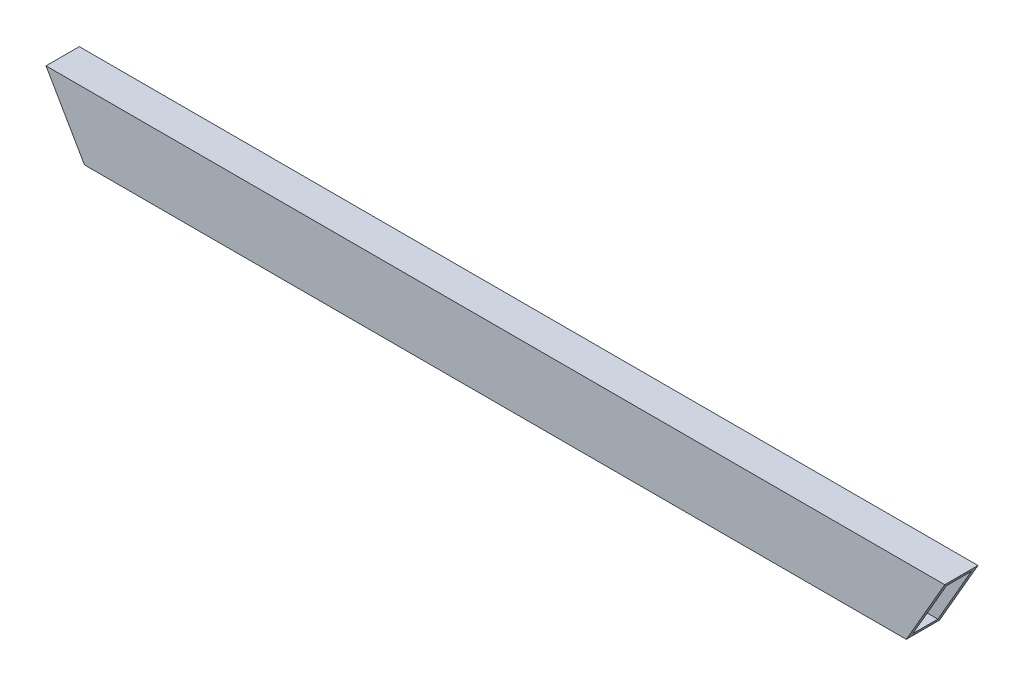
ISO-10303-21;
HEADER;
FILE_DESCRIPTION(('STEP AP214'),'2;1');
FILE_NAME('part.step','',(''),(''),'','','');
FILE_SCHEMA(('AUTOMOTIVE_DESIGN { 1 0 10303 214 1 1 1 1 }'));
ENDSEC;
DATA;
#1=APPLICATION_CONTEXT('core data for automotive mechanical design processes');
#2=APPLICATION_PROTOCOL_DEFINITION('international standard','automotive_design',2000,#1);
#3=PRODUCT_CONTEXT('',#1,'mechanical');
#4=PRODUCT('Part','Part','',(#3));
#5=PRODUCT_RELATED_PRODUCT_CATEGORY('part','',(#4));
#6=PRODUCT_DEFINITION_FORMATION('','',#4);
#7=PRODUCT_DEFINITION_CONTEXT('part definition',#1,'design');
#8=PRODUCT_DEFINITION('design','',#6,#7);
#9=PRODUCT_DEFINITION_SHAPE('','',#8);
#10=(LENGTH_UNIT() NAMED_UNIT(*) SI_UNIT(.MILLI.,.METRE.));
#11=(NAMED_UNIT(*) PLANE_ANGLE_UNIT() SI_UNIT($,.RADIAN.));
#12=(NAMED_UNIT(*) SI_UNIT($,.STERADIAN.) SOLID_ANGLE_UNIT());
#13=UNCERTAINTY_MEASURE_WITH_UNIT(LENGTH_MEASURE(1.E-05),#10,'distance_accuracy_value','');
#14=(GEOMETRIC_REPRESENTATION_CONTEXT(3) GLOBAL_UNCERTAINTY_ASSIGNED_CONTEXT((#13)) GLOBAL_UNIT_ASSIGNED_CONTEXT((#10,
#11,#12)) REPRESENTATION_CONTEXT('',''));
#15=CARTESIAN_POINT('',(0.,0.,0.));
#16=DIRECTION('',(0.,0.,1.));
#17=DIRECTION('',(1.,0.,0.));
#18=AXIS2_PLACEMENT_3D('',#15,#16,#17);
#19=CARTESIAN_POINT('',(342.9,-22.225,9.525));
#20=DIRECTION('',(0.,1.,0.));
#21=DIRECTION('',(0.,0.,1.));
#22=AXIS2_PLACEMENT_3D('',#19,#20,#21);
#23=PLANE('',#22);
#24=DIRECTION('',(0.,0.,-1.));
#25=VECTOR('',#24,1.);
#26=CARTESIAN_POINT('',(-315.403693429844,-22.225,9.525));
#27=LINE('',#26,#25);
#28=CARTESIAN_POINT('',(-315.403693429844,-22.225,9.525));
#29=VERTEX_POINT('',#28);
#30=CARTESIAN_POINT('',(-315.403693429844,-22.225,-9.525));
#31=VERTEX_POINT('',#30);
#32=EDGE_CURVE('E11',#29,#31,#27,.T.);
#33=ORIENTED_EDGE('',*,*,#32,.F.);
#34=DIRECTION('',(-1.,0.,0.));
#35=VECTOR('',#34,1.);
#36=CARTESIAN_POINT('',(342.9,-22.225,9.525));
#37=LINE('',#36,#35);
#38=CARTESIAN_POINT('',(315.403693429844,-22.225,9.525));
#39=VERTEX_POINT('',#38);
#40=EDGE_CURVE('E149',#39,#29,#37,.T.);
#41=ORIENTED_EDGE('',*,*,#40,.F.);
#42=DIRECTION('',(0.,0.,-1.));
#43=VECTOR('',#42,1.);
#44=CARTESIAN_POINT('',(315.403693429844,-22.225,9.525));
#45=LINE('',#44,#43);
#46=CARTESIAN_POINT('',(315.403693429844,-22.225,-9.525));
#47=VERTEX_POINT('',#46);
#48=EDGE_CURVE('E52',#39,#47,#45,.T.);
#49=ORIENTED_EDGE('',*,*,#48,.T.);
#50=DIRECTION('',(-1.,0.,0.));
#51=VECTOR('',#50,1.);
#52=CARTESIAN_POINT('',(342.9,-22.225,-9.525));
#53=LINE('',#52,#51);
#54=EDGE_CURVE('E147',#47,#31,#53,.T.);
#55=ORIENTED_EDGE('',*,*,#54,.T.);
#56=EDGE_LOOP('',(#33,#41,#49,#55));
#57=FACE_BOUND('',#56,.T.);
#58=ADVANCED_FACE('F43',(#57),#23,.T.);
#59=CARTESIAN_POINT('',(342.9,-22.225,9.525));
#60=DIRECTION('',(0.,0.,-1.));
#61=DIRECTION('',(-1.,0.,0.));
#62=AXIS2_PLACEMENT_3D('',#59,#60,#61);
#63=PLANE('',#62);
#64=DIRECTION('',(0.500000000000004,-0.866025403784436,0.));
#65=VECTOR('',#64,1.);
#66=CARTESIAN_POINT('',(-150.82777007238,-307.278860957686,9.525));
#67=LINE('',#66,#65);
#68=CARTESIAN_POINT('',(-341.066912895323,22.2250000000001,9.525));
#69=VERTEX_POINT('',#68);
#70=EDGE_CURVE('E201',#69,#29,#67,.T.);
#71=ORIENTED_EDGE('',*,*,#70,.F.);
#72=DIRECTION('',(-1.,0.,0.));
#73=VECTOR('',#72,1.);
#74=CARTESIAN_POINT('',(342.9,22.225,9.525));
#75=LINE('',#74,#73);
#76=CARTESIAN_POINT('',(341.066912895323,22.225,9.525));
#77=VERTEX_POINT('',#76);
#78=EDGE_CURVE('E164',#77,#69,#75,.T.);
#79=ORIENTED_EDGE('',*,*,#78,.F.);
#80=DIRECTION('',(-0.500000000000004,-0.866025403784436,0.));
#81=VECTOR('',#80,1.);
#82=CARTESIAN_POINT('',(322.277770072383,-10.3187499999998,9.525));
#83=LINE('',#82,#81);
#84=EDGE_CURVE('E184',#77,#39,#83,.T.);
#85=ORIENTED_EDGE('',*,*,#84,.T.);
#86=ORIENTED_EDGE('',*,*,#40,.T.);
#87=EDGE_LOOP('',(#71,#79,#85,#86));
#88=FACE_BOUND('',#87,.T.);
#89=ADVANCED_FACE('F214',(#88),#63,.T.);
#90=CARTESIAN_POINT('',(342.9,22.225,9.525));
#91=DIRECTION('',(0.,-1.,0.));
#92=DIRECTION('',(0.,0.,-1.));
#93=AXIS2_PLACEMENT_3D('',#90,#91,#92);
#94=PLANE('',#93);
#95=DIRECTION('',(0.,0.,1.));
#96=VECTOR('',#95,1.);
#97=CARTESIAN_POINT('',(-341.066912895323,22.225,9.525));
#98=LINE('',#97,#96);
#99=CARTESIAN_POINT('',(-341.066912895323,22.225,-9.525));
#100=VERTEX_POINT('',#99);
#101=EDGE_CURVE('E204',#100,#69,#98,.T.);
#102=ORIENTED_EDGE('',*,*,#101,.F.);
#103=DIRECTION('',(-1.,0.,0.));
#104=VECTOR('',#103,1.);
#105=CARTESIAN_POINT('',(342.9,22.225,-9.525));
#106=LINE('',#105,#104);
#107=CARTESIAN_POINT('',(341.066912895323,22.225,-9.525));
#108=VERTEX_POINT('',#107);
#109=EDGE_CURVE('E128',#108,#100,#106,.T.);
#110=ORIENTED_EDGE('',*,*,#109,.F.);
#111=DIRECTION('',(0.,0.,1.));
#112=VECTOR('',#111,1.);
#113=CARTESIAN_POINT('',(341.066912895323,22.225,9.525));
#114=LINE('',#113,#112);
#115=EDGE_CURVE('E187',#108,#77,#114,.T.);
#116=ORIENTED_EDGE('',*,*,#115,.T.);
#117=ORIENTED_EDGE('',*,*,#78,.T.);
#118=EDGE_LOOP('',(#102,#110,#116,#117));
#119=FACE_BOUND('',#118,.T.);
#120=ADVANCED_FACE('F211',(#119),#94,.T.);
#121=CARTESIAN_POINT('',(342.9,-22.225,-9.525));
#122=DIRECTION('',(0.,0.,1.));
#123=DIRECTION('',(1.,0.,0.));
#124=AXIS2_PLACEMENT_3D('',#121,#122,#123);
#125=PLANE('',#124);
#126=DIRECTION('',(-0.500000000000004,0.866025403784436,0.));
#127=VECTOR('',#126,1.);
#128=CARTESIAN_POINT('',(-150.82777007238,-307.278860957686,-9.525));
#129=LINE('',#128,#127);
#130=EDGE_CURVE('E159',#31,#100,#129,.T.);
#131=ORIENTED_EDGE('',*,*,#130,.F.);
#132=ORIENTED_EDGE('',*,*,#54,.F.);
#133=DIRECTION('',(0.500000000000004,0.866025403784436,0.));
#134=VECTOR('',#133,1.);
#135=CARTESIAN_POINT('',(322.277770072383,-10.3187499999998,-9.525));
#136=LINE('',#135,#134);
#137=EDGE_CURVE('E157',#47,#108,#136,.T.);
#138=ORIENTED_EDGE('',*,*,#137,.T.);
#139=ORIENTED_EDGE('',*,*,#109,.T.);
#140=EDGE_LOOP('',(#131,#132,#138,#139));
#141=FACE_BOUND('',#140,.T.);
#142=ADVANCED_FACE('F155',(#141),#125,.T.);
#143=CARTESIAN_POINT('',(246.176477371936,-142.130055478843,12.7));
#144=DIRECTION('',(0.866025403784436,-0.500000000000004,0.));
#145=DIRECTION('',(0.500000000000004,0.866025403784436,0.));
#146=AXIS2_PLACEMENT_3D('',#143,#144,#145);
#147=PLANE('',#146);
#148=ORIENTED_EDGE('',*,*,#48,.F.);
#149=ORIENTED_EDGE('',*,*,#84,.F.);
#150=ORIENTED_EDGE('',*,*,#115,.F.);
#151=ORIENTED_EDGE('',*,*,#137,.F.);
#152=EDGE_LOOP('',(#148,#149,#150,#151));
#153=FACE_BOUND('',#152,.T.);
#154=DIRECTION('',(0.500000000000004,0.866025403784436,0.));
#155=VECTOR('',#154,1.);
#156=CARTESIAN_POINT('',(320.902954743875,-12.6999999999998,-12.7));
#157=LINE('',#156,#155);
#158=CARTESIAN_POINT('',(313.570606325167,-25.4,-12.7));
#159=VERTEX_POINT('',#158);
#160=CARTESIAN_POINT('',(342.9,25.4,-12.7));
#161=VERTEX_POINT('',#160);
#162=EDGE_CURVE('E180',#159,#161,#157,.T.);
#163=ORIENTED_EDGE('',*,*,#162,.T.);
#164=DIRECTION('',(0.,0.,1.));
#165=VECTOR('',#164,1.);
#166=CARTESIAN_POINT('',(342.9,25.4,12.7));
#167=LINE('',#166,#165);
#168=CARTESIAN_POINT('',(342.9,25.4,12.7));
#169=VERTEX_POINT('',#168);
#170=EDGE_CURVE('E127',#161,#169,#167,.T.);
#171=ORIENTED_EDGE('',*,*,#170,.T.);
#172=DIRECTION('',(-0.500000000000005,-0.866025403784436,0.));
#173=VECTOR('',#172,1.);
#174=CARTESIAN_POINT('',(246.176477371936,-142.130055478843,12.7));
#175=LINE('',#174,#173);
#176=CARTESIAN_POINT('',(313.570606325167,-25.4,12.7));
#177=VERTEX_POINT('',#176);
#178=EDGE_CURVE('E59',#169,#177,#175,.T.);
#179=ORIENTED_EDGE('',*,*,#178,.T.);
#180=DIRECTION('',(0.,0.,-1.));
#181=VECTOR('',#180,1.);
#182=CARTESIAN_POINT('',(313.570606325167,-25.4,12.7));
#183=LINE('',#182,#181);
#184=EDGE_CURVE('E116',#177,#159,#183,.T.);
#185=ORIENTED_EDGE('',*,*,#184,.T.);
#186=EDGE_LOOP('',(#163,#171,#179,#185));
#187=FACE_BOUND('',#186,.T.);
#188=ADVANCED_FACE('F215',(#153,#187),#147,.T.);
#189=CARTESIAN_POINT('',(-246.176477371936,-142.130055478843,12.7));
#190=DIRECTION('',(0.866025403784436,0.500000000000004,0.));
#191=DIRECTION('',(-0.500000000000004,0.866025403784436,0.));
#192=AXIS2_PLACEMENT_3D('',#189,#190,#191);
#193=PLANE('',#192);
#194=ORIENTED_EDGE('',*,*,#130,.T.);
#195=ORIENTED_EDGE('',*,*,#101,.T.);
#196=ORIENTED_EDGE('',*,*,#70,.T.);
#197=ORIENTED_EDGE('',*,*,#32,.T.);
#198=EDGE_LOOP('',(#194,#195,#196,#197));
#199=FACE_BOUND('',#198,.T.);
#200=DIRECTION('',(0.,0.,-1.));
#201=VECTOR('',#200,1.);
#202=CARTESIAN_POINT('',(-313.570606325167,-25.4,12.7));
#203=LINE('',#202,#201);
#204=CARTESIAN_POINT('',(-313.570606325167,-25.4,12.7));
#205=VERTEX_POINT('',#204);
#206=CARTESIAN_POINT('',(-313.570606325167,-25.4,-12.7));
#207=VERTEX_POINT('',#206);
#208=EDGE_CURVE('E110',#205,#207,#203,.T.);
#209=ORIENTED_EDGE('',*,*,#208,.F.);
#210=DIRECTION('',(0.500000000000005,-0.866025403784436,0.));
#211=VECTOR('',#210,1.);
#212=CARTESIAN_POINT('',(-246.176477371936,-142.130055478843,12.7));
#213=LINE('',#212,#211);
#214=CARTESIAN_POINT('',(-342.9,25.4,12.7));
#215=VERTEX_POINT('',#214);
#216=EDGE_CURVE('E106',#215,#205,#213,.T.);
#217=ORIENTED_EDGE('',*,*,#216,.F.);
#218=DIRECTION('',(0.,0.,1.));
#219=VECTOR('',#218,1.);
#220=CARTESIAN_POINT('',(-342.9,25.4,12.7));
#221=LINE('',#220,#219);
#222=CARTESIAN_POINT('',(-342.9,25.4,-12.7));
#223=VERTEX_POINT('',#222);
#224=EDGE_CURVE('E109',#223,#215,#221,.T.);
#225=ORIENTED_EDGE('',*,*,#224,.F.);
#226=DIRECTION('',(-0.500000000000004,0.866025403784436,0.));
#227=VECTOR('',#226,1.);
#228=CARTESIAN_POINT('',(-149.452954743872,-309.660110957686,-12.7));
#229=LINE('',#228,#227);
#230=EDGE_CURVE('E67',#207,#223,#229,.T.);
#231=ORIENTED_EDGE('',*,*,#230,.F.);
#232=EDGE_LOOP('',(#209,#217,#225,#231));
#233=FACE_BOUND('',#232,.T.);
#234=ADVANCED_FACE('F108',(#199,#233),#193,.F.);
#235=CARTESIAN_POINT('',(342.9,-25.4,-12.7));
#236=DIRECTION('',(0.,0.,1.));
#237=DIRECTION('',(1.,0.,0.));
#238=AXIS2_PLACEMENT_3D('',#235,#236,#237);
#239=PLANE('',#238);
#240=DIRECTION('',(-1.,0.,0.));
#241=VECTOR('',#240,1.);
#242=CARTESIAN_POINT('',(342.9,-25.4,-12.7));
#243=LINE('',#242,#241);
#244=EDGE_CURVE('E137',#159,#207,#243,.T.);
#245=ORIENTED_EDGE('',*,*,#244,.T.);
#246=ORIENTED_EDGE('',*,*,#230,.T.);
#247=DIRECTION('',(-1.,0.,0.));
#248=VECTOR('',#247,1.);
#249=CARTESIAN_POINT('',(342.9,25.4,-12.7));
#250=LINE('',#249,#248);
#251=EDGE_CURVE('E125',#161,#223,#250,.T.);
#252=ORIENTED_EDGE('',*,*,#251,.F.);
#253=ORIENTED_EDGE('',*,*,#162,.F.);
#254=EDGE_LOOP('',(#245,#246,#252,#253));
#255=FACE_BOUND('',#254,.T.);
#256=ADVANCED_FACE('F45',(#255),#239,.F.);
#257=CARTESIAN_POINT('',(342.9,-25.4,12.7));
#258=DIRECTION('',(0.,0.,-1.));
#259=DIRECTION('',(-1.,0.,0.));
#260=AXIS2_PLACEMENT_3D('',#257,#258,#259);
#261=PLANE('',#260);
#262=DIRECTION('',(-1.,0.,0.));
#263=VECTOR('',#262,1.);
#264=CARTESIAN_POINT('',(342.9,25.4,12.7));
#265=LINE('',#264,#263);
#266=EDGE_CURVE('E123',#169,#215,#265,.T.);
#267=ORIENTED_EDGE('',*,*,#266,.T.);
#268=ORIENTED_EDGE('',*,*,#216,.T.);
#269=DIRECTION('',(-1.,0.,0.));
#270=VECTOR('',#269,1.);
#271=CARTESIAN_POINT('',(342.9,-25.4,12.7));
#272=LINE('',#271,#270);
#273=EDGE_CURVE('E132',#177,#205,#272,.T.);
#274=ORIENTED_EDGE('',*,*,#273,.F.);
#275=ORIENTED_EDGE('',*,*,#178,.F.);
#276=EDGE_LOOP('',(#267,#268,#274,#275));
#277=FACE_BOUND('',#276,.T.);
#278=ADVANCED_FACE('F130',(#277),#261,.F.);
#279=CARTESIAN_POINT('',(342.9,-25.4,12.7));
#280=DIRECTION('',(0.,1.,0.));
#281=DIRECTION('',(0.,0.,1.));
#282=AXIS2_PLACEMENT_3D('',#279,#280,#281);
#283=PLANE('',#282);
#284=ORIENTED_EDGE('',*,*,#273,.T.);
#285=ORIENTED_EDGE('',*,*,#208,.T.);
#286=ORIENTED_EDGE('',*,*,#244,.F.);
#287=ORIENTED_EDGE('',*,*,#184,.F.);
#288=EDGE_LOOP('',(#284,#285,#286,#287));
#289=FACE_BOUND('',#288,.T.);
#290=ADVANCED_FACE('F182',(#289),#283,.F.);
#291=CARTESIAN_POINT('',(342.9,25.4,12.7));
#292=DIRECTION('',(0.,-1.,0.));
#293=DIRECTION('',(0.,0.,-1.));
#294=AXIS2_PLACEMENT_3D('',#291,#292,#293);
#295=PLANE('',#294);
#296=ORIENTED_EDGE('',*,*,#224,.T.);
#297=ORIENTED_EDGE('',*,*,#266,.F.);
#298=ORIENTED_EDGE('',*,*,#170,.F.);
#299=ORIENTED_EDGE('',*,*,#251,.T.);
#300=EDGE_LOOP('',(#296,#297,#298,#299));
#301=FACE_BOUND('',#300,.T.);
#302=ADVANCED_FACE('F121',(#301),#295,.F.);
#303=CLOSED_SHELL('',(#58,#89,#120,#142,#188,#234,#256,#278,#290,#302));
#304=MANIFOLD_SOLID_BREP('B2',#303);
#305=ADVANCED_BREP_SHAPE_REPRESENTATION('',(#18,#304),#14);
#306=SHAPE_DEFINITION_REPRESENTATION(#9,#305);
ENDSEC;
END-ISO-10303-21;
